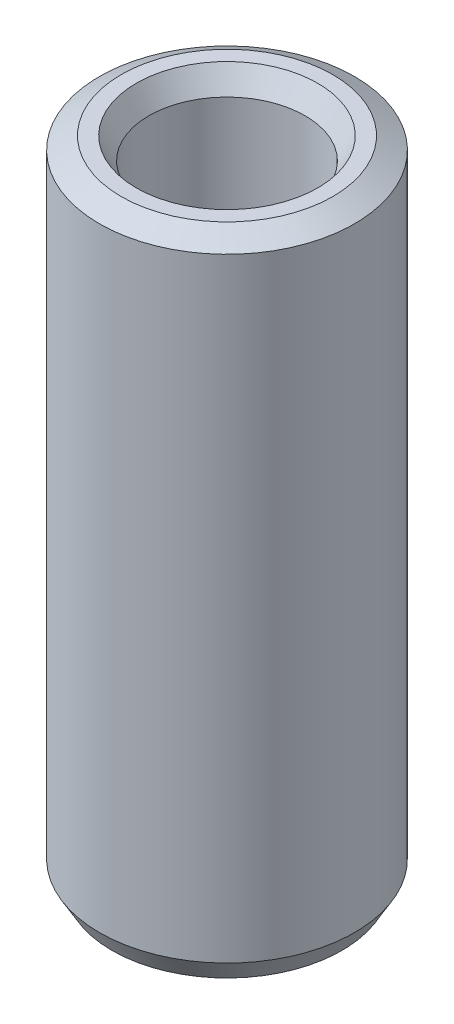
ISO-10303-21;
HEADER;
FILE_DESCRIPTION(('STEP AP214'),'2;1');
FILE_NAME('part.step','',(''),(''),'','','');
FILE_SCHEMA(('AUTOMOTIVE_DESIGN { 1 0 10303 214 1 1 1 1 }'));
ENDSEC;
DATA;
#1=APPLICATION_CONTEXT('core data for automotive mechanical design processes');
#2=APPLICATION_PROTOCOL_DEFINITION('international standard','automotive_design',2000,#1);
#3=PRODUCT_CONTEXT('',#1,'mechanical');
#4=PRODUCT('Part','Part','',(#3));
#5=PRODUCT_RELATED_PRODUCT_CATEGORY('part','',(#4));
#6=PRODUCT_DEFINITION_FORMATION('','',#4);
#7=PRODUCT_DEFINITION_CONTEXT('part definition',#1,'design');
#8=PRODUCT_DEFINITION('design','',#6,#7);
#9=PRODUCT_DEFINITION_SHAPE('','',#8);
#10=(LENGTH_UNIT() NAMED_UNIT(*) SI_UNIT(.MILLI.,.METRE.));
#11=(NAMED_UNIT(*) PLANE_ANGLE_UNIT() SI_UNIT($,.RADIAN.));
#12=(NAMED_UNIT(*) SI_UNIT($,.STERADIAN.) SOLID_ANGLE_UNIT());
#13=UNCERTAINTY_MEASURE_WITH_UNIT(LENGTH_MEASURE(1.E-05),#10,'distance_accuracy_value','');
#14=(GEOMETRIC_REPRESENTATION_CONTEXT(3) GLOBAL_UNCERTAINTY_ASSIGNED_CONTEXT((#13)) GLOBAL_UNIT_ASSIGNED_CONTEXT((#10,
#11,#12)) REPRESENTATION_CONTEXT('',''));
#15=CARTESIAN_POINT('',(0.,0.,0.));
#16=DIRECTION('',(0.,0.,1.));
#17=DIRECTION('',(1.,0.,0.));
#18=AXIS2_PLACEMENT_3D('',#15,#16,#17);
#19=CARTESIAN_POINT('',(0.,139.735595583597,0.));
#20=DIRECTION('',(0.,-1.,0.));
#21=DIRECTION('',(0.,0.,-1.));
#22=AXIS2_PLACEMENT_3D('',#19,#20,#21);
#23=CYLINDRICAL_SURFACE('',#22,27.5);
#24=CARTESIAN_POINT('',(0.,4.70613369900239,0.));
#25=DIRECTION('',(0.,1.,0.));
#26=DIRECTION('',(0.,0.,1.));
#27=AXIS2_PLACEMENT_3D('',#24,#25,#26);
#28=CIRCLE('',#27,27.5);
#29=CARTESIAN_POINT('',(0.,4.70613369900239,27.5));
#30=VERTEX_POINT('',#29);
#31=EDGE_CURVE('E10',#30,#30,#28,.T.);
#32=ORIENTED_EDGE('',*,*,#31,.T.);
#33=EDGE_LOOP('',(#32));
#34=FACE_BOUND('',#33,.T.);
#35=CARTESIAN_POINT('',(0.,137.018508025635,0.));
#36=DIRECTION('',(0.,1.,0.));
#37=DIRECTION('',(0.,0.,1.));
#38=AXIS2_PLACEMENT_3D('',#35,#36,#37);
#39=CIRCLE('',#38,27.5);
#40=CARTESIAN_POINT('',(0.,137.018508025635,27.5));
#41=VERTEX_POINT('',#40);
#42=EDGE_CURVE('E50',#41,#41,#39,.F.);
#43=ORIENTED_EDGE('',*,*,#42,.T.);
#44=EDGE_LOOP('',(#43));
#45=FACE_BOUND('',#44,.T.);
#46=ADVANCED_FACE('F39',(#34,#45),#23,.T.);
#47=CARTESIAN_POINT('',(0.,139.735595583597,0.));
#48=DIRECTION('',(0.,1.,0.));
#49=DIRECTION('',(0.,0.,1.));
#50=AXIS2_PLACEMENT_3D('',#47,#48,#49);
#51=PLANE('',#50);
#52=CARTESIAN_POINT('',(0.,139.735595583597,0.));
#53=DIRECTION('',(0.,1.,0.));
#54=DIRECTION('',(0.,0.,1.));
#55=AXIS2_PLACEMENT_3D('',#52,#53,#54);
#56=CIRCLE('',#55,19.5551899443006);
#57=CARTESIAN_POINT('',(0.,139.735595583597,19.5551899443006));
#58=VERTEX_POINT('',#57);
#59=EDGE_CURVE('E58',#58,#58,#56,.F.);
#60=ORIENTED_EDGE('',*,*,#59,.T.);
#61=EDGE_LOOP('',(#60));
#62=FACE_BOUND('',#61,.T.);
#63=CARTESIAN_POINT('',(0.,139.735595583597,0.));
#64=DIRECTION('',(0.,1.,0.));
#65=DIRECTION('',(0.,0.,1.));
#66=AXIS2_PLACEMENT_3D('',#63,#64,#65);
#67=CIRCLE('',#66,22.7938663009976);
#68=CARTESIAN_POINT('',(0.,139.735595583597,22.7938663009976));
#69=VERTEX_POINT('',#68);
#70=EDGE_CURVE('E61',#69,#69,#67,.T.);
#71=ORIENTED_EDGE('',*,*,#70,.T.);
#72=EDGE_LOOP('',(#71));
#73=FACE_BOUND('',#72,.T.);
#74=ADVANCED_FACE('F88',(#62,#73),#51,.T.);
#75=CARTESIAN_POINT('',(0.,0.,0.));
#76=DIRECTION('',(0.,1.,0.));
#77=DIRECTION('',(0.,0.,1.));
#78=AXIS2_PLACEMENT_3D('',#75,#76,#77);
#79=PLANE('',#78);
#80=CARTESIAN_POINT('',(0.,0.,0.));
#81=DIRECTION('',(0.,1.,0.));
#82=DIRECTION('',(0.,0.,1.));
#83=AXIS2_PLACEMENT_3D('',#80,#81,#82);
#84=CIRCLE('',#83,21.5442360853415);
#85=CARTESIAN_POINT('',(0.,0.,21.5442360853415));
#86=VERTEX_POINT('',#85);
#87=EDGE_CURVE('E51',#86,#86,#84,.T.);
#88=ORIENTED_EDGE('',*,*,#87,.T.);
#89=EDGE_LOOP('',(#88));
#90=FACE_BOUND('',#89,.T.);
#91=CARTESIAN_POINT('',(0.,0.,0.));
#92=DIRECTION('',(0.,1.,0.));
#93=DIRECTION('',(0.,0.,1.));
#94=AXIS2_PLACEMENT_3D('',#91,#92,#93);
#95=CIRCLE('',#94,24.7829124420386);
#96=CARTESIAN_POINT('',(0.,0.,24.7829124420386));
#97=VERTEX_POINT('',#96);
#98=EDGE_CURVE('E54',#97,#97,#95,.F.);
#99=ORIENTED_EDGE('',*,*,#98,.T.);
#100=EDGE_LOOP('',(#99));
#101=FACE_BOUND('',#100,.T.);
#102=ADVANCED_FACE('F83',(#90,#101),#79,.F.);
#103=CARTESIAN_POINT('',(0.,139.735595583597,0.));
#104=DIRECTION('',(0.,-1.,0.));
#105=DIRECTION('',(0.,0.,-1.));
#106=AXIS2_PLACEMENT_3D('',#103,#104,#105);
#107=CYLINDRICAL_SURFACE('',#106,16.8381023863391);
#108=CARTESIAN_POINT('',(0.,135.029461884594,0.));
#109=DIRECTION('',(0.,1.,0.));
#110=DIRECTION('',(0.,0.,1.));
#111=AXIS2_PLACEMENT_3D('',#108,#109,#110);
#112=CIRCLE('',#111,16.8381023863391);
#113=CARTESIAN_POINT('',(0.,135.029461884594,16.8381023863391));
#114=VERTEX_POINT('',#113);
#115=EDGE_CURVE('E67',#114,#114,#112,.T.);
#116=ORIENTED_EDGE('',*,*,#115,.T.);
#117=EDGE_LOOP('',(#116));
#118=FACE_BOUND('',#117,.T.);
#119=CARTESIAN_POINT('',(0.,2.71708755796141,0.));
#120=DIRECTION('',(0.,1.,0.));
#121=DIRECTION('',(0.,0.,1.));
#122=AXIS2_PLACEMENT_3D('',#119,#120,#121);
#123=CIRCLE('',#122,16.8381023863391);
#124=CARTESIAN_POINT('',(0.,2.71708755796141,16.8381023863391));
#125=VERTEX_POINT('',#124);
#126=EDGE_CURVE('E69',#125,#125,#123,.F.);
#127=ORIENTED_EDGE('',*,*,#126,.T.);
#128=EDGE_LOOP('',(#127));
#129=FACE_BOUND('',#128,.T.);
#130=ADVANCED_FACE('F71',(#118,#129),#107,.F.);
#131=CARTESIAN_POINT('',(0.,135.029461884594,0.));
#132=DIRECTION('',(0.,1.,0.));
#133=DIRECTION('',(0.,0.,1.));
#134=AXIS2_PLACEMENT_3D('',#131,#132,#133);
#135=CONICAL_SURFACE('',#134,16.8381023863391,0.523598775598301);
#136=ORIENTED_EDGE('',*,*,#59,.F.);
#137=EDGE_LOOP('',(#136));
#138=FACE_BOUND('',#137,.T.);
#139=ORIENTED_EDGE('',*,*,#115,.F.);
#140=EDGE_LOOP('',(#139));
#141=FACE_BOUND('',#140,.T.);
#142=ADVANCED_FACE('F77',(#138,#141),#135,.F.);
#143=CARTESIAN_POINT('',(0.,0.,0.));
#144=DIRECTION('',(0.,-1.,0.));
#145=DIRECTION('',(0.,0.,-1.));
#146=AXIS2_PLACEMENT_3D('',#143,#144,#145);
#147=CONICAL_SURFACE('',#146,21.5442360853415,1.04719755119659);
#148=ORIENTED_EDGE('',*,*,#126,.F.);
#149=EDGE_LOOP('',(#148));
#150=FACE_BOUND('',#149,.T.);
#151=ORIENTED_EDGE('',*,*,#87,.F.);
#152=EDGE_LOOP('',(#151));
#153=FACE_BOUND('',#152,.T.);
#154=ADVANCED_FACE('F73',(#150,#153),#147,.F.);
#155=CARTESIAN_POINT('',(0.,4.70613369900239,0.));
#156=DIRECTION('',(0.,1.,0.));
#157=DIRECTION('',(0.,0.,1.));
#158=AXIS2_PLACEMENT_3D('',#155,#156,#157);
#159=CONICAL_SURFACE('',#158,27.5,0.523598775598303);
#160=ORIENTED_EDGE('',*,*,#98,.F.);
#161=EDGE_LOOP('',(#160));
#162=FACE_BOUND('',#161,.T.);
#163=ORIENTED_EDGE('',*,*,#31,.F.);
#164=EDGE_LOOP('',(#163));
#165=FACE_BOUND('',#164,.T.);
#166=ADVANCED_FACE('F76',(#162,#165),#159,.T.);
#167=CARTESIAN_POINT('',(0.,139.735595583597,0.));
#168=DIRECTION('',(0.,-1.,0.));
#169=DIRECTION('',(0.,0.,-1.));
#170=AXIS2_PLACEMENT_3D('',#167,#168,#169);
#171=CONICAL_SURFACE('',#170,22.7938663009976,1.04719755119659);
#172=ORIENTED_EDGE('',*,*,#42,.F.);
#173=EDGE_LOOP('',(#172));
#174=FACE_BOUND('',#173,.T.);
#175=ORIENTED_EDGE('',*,*,#70,.F.);
#176=EDGE_LOOP('',(#175));
#177=FACE_BOUND('',#176,.T.);
#178=ADVANCED_FACE('F45',(#174,#177),#171,.T.);
#179=CLOSED_SHELL('',(#46,#74,#102,#130,#142,#154,#166,#178));
#180=MANIFOLD_SOLID_BREP('B2',#179);
#181=ADVANCED_BREP_SHAPE_REPRESENTATION('',(#18,#180),#14);
#182=SHAPE_DEFINITION_REPRESENTATION(#9,#181);
ENDSEC;
END-ISO-10303-21;
